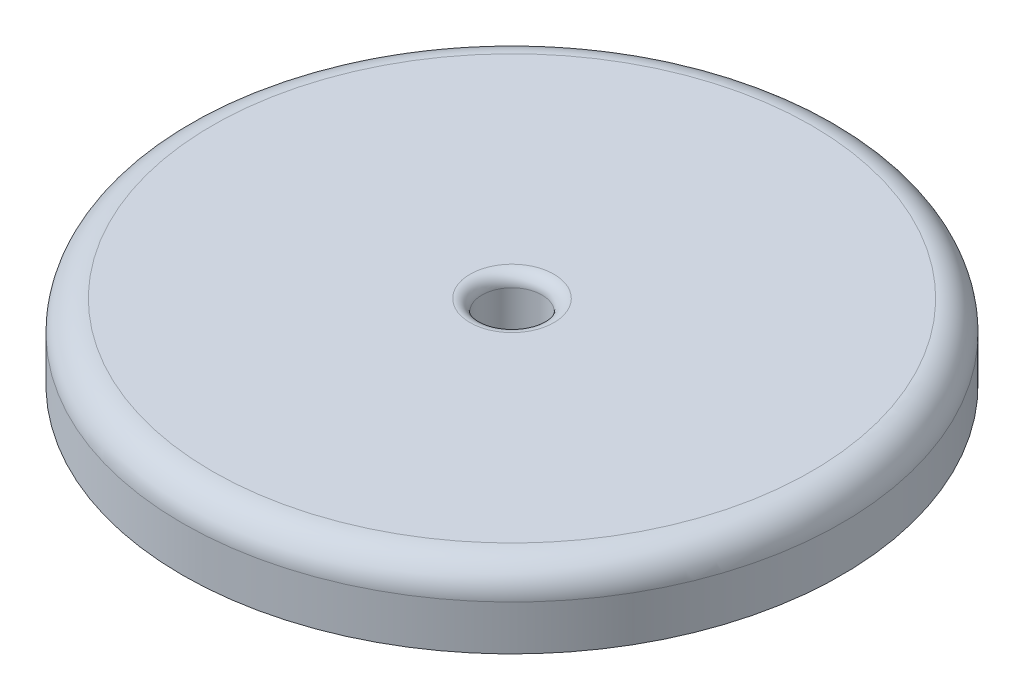
ISO-10303-21;
HEADER;
FILE_DESCRIPTION(('STEP AP214'),'2;1');
FILE_NAME('part.step','',(''),(''),'','','');
FILE_SCHEMA(('AUTOMOTIVE_DESIGN { 1 0 10303 214 1 1 1 1 }'));
ENDSEC;
DATA;
#1=APPLICATION_CONTEXT('core data for automotive mechanical design processes');
#2=APPLICATION_PROTOCOL_DEFINITION('international standard','automotive_design',2000,#1);
#3=PRODUCT_CONTEXT('',#1,'mechanical');
#4=PRODUCT('Part','Part','',(#3));
#5=PRODUCT_RELATED_PRODUCT_CATEGORY('part','',(#4));
#6=PRODUCT_DEFINITION_FORMATION('','',#4);
#7=PRODUCT_DEFINITION_CONTEXT('part definition',#1,'design');
#8=PRODUCT_DEFINITION('design','',#6,#7);
#9=PRODUCT_DEFINITION_SHAPE('','',#8);
#10=(LENGTH_UNIT() NAMED_UNIT(*) SI_UNIT(.MILLI.,.METRE.));
#11=(NAMED_UNIT(*) PLANE_ANGLE_UNIT() SI_UNIT($,.RADIAN.));
#12=(NAMED_UNIT(*) SI_UNIT($,.STERADIAN.) SOLID_ANGLE_UNIT());
#13=UNCERTAINTY_MEASURE_WITH_UNIT(LENGTH_MEASURE(1.E-05),#10,'distance_accuracy_value','');
#14=(GEOMETRIC_REPRESENTATION_CONTEXT(3) GLOBAL_UNCERTAINTY_ASSIGNED_CONTEXT((#13)) GLOBAL_UNIT_ASSIGNED_CONTEXT((#10,
#11,#12)) REPRESENTATION_CONTEXT('',''));
#15=CARTESIAN_POINT('',(0.,0.,0.));
#16=DIRECTION('',(0.,0.,1.));
#17=DIRECTION('',(1.,0.,0.));
#18=AXIS2_PLACEMENT_3D('',#15,#16,#17);
#19=CARTESIAN_POINT('',(0.,2.5,0.));
#20=DIRECTION('',(0.,-1.,0.));
#21=DIRECTION('',(0.,0.,-1.));
#22=AXIS2_PLACEMENT_3D('',#19,#20,#21);
#23=CYLINDRICAL_SURFACE('',#22,11.);
#24=CARTESIAN_POINT('',(0.,1.5,0.));
#25=DIRECTION('',(0.,1.,0.));
#26=DIRECTION('',(0.,0.,1.));
#27=AXIS2_PLACEMENT_3D('',#24,#25,#26);
#28=CIRCLE('',#27,11.);
#29=CARTESIAN_POINT('',(0.,1.5,11.));
#30=VERTEX_POINT('',#29);
#31=EDGE_CURVE('E51',#30,#30,#28,.F.);
#32=ORIENTED_EDGE('',*,*,#31,.T.);
#33=EDGE_LOOP('',(#32));
#34=FACE_BOUND('',#33,.T.);
#35=CARTESIAN_POINT('',(0.,0.,0.));
#36=DIRECTION('',(0.,1.,0.));
#37=DIRECTION('',(0.,0.,1.));
#38=AXIS2_PLACEMENT_3D('',#35,#36,#37);
#39=CIRCLE('',#38,11.);
#40=CARTESIAN_POINT('',(0.,0.,11.));
#41=VERTEX_POINT('',#40);
#42=EDGE_CURVE('E63',#41,#41,#39,.T.);
#43=ORIENTED_EDGE('',*,*,#42,.T.);
#44=EDGE_LOOP('',(#43));
#45=FACE_BOUND('',#44,.T.);
#46=ADVANCED_FACE('F31',(#34,#45),#23,.T.);
#47=CARTESIAN_POINT('',(0.,2.5,0.));
#48=DIRECTION('',(0.,1.,0.));
#49=DIRECTION('',(0.,0.,1.));
#50=AXIS2_PLACEMENT_3D('',#47,#48,#49);
#51=PLANE('',#50);
#52=CARTESIAN_POINT('',(0.,2.5,0.));
#53=DIRECTION('',(0.,1.,0.));
#54=DIRECTION('',(0.,0.,1.));
#55=AXIS2_PLACEMENT_3D('',#52,#53,#54);
#56=CIRCLE('',#55,10.);
#57=CARTESIAN_POINT('',(0.,2.5,10.));
#58=VERTEX_POINT('',#57);
#59=EDGE_CURVE('E54',#58,#58,#56,.T.);
#60=ORIENTED_EDGE('',*,*,#59,.T.);
#61=EDGE_LOOP('',(#60));
#62=FACE_BOUND('',#61,.T.);
#63=CARTESIAN_POINT('',(0.,2.5,0.));
#64=DIRECTION('',(0.,1.,0.));
#65=DIRECTION('',(0.,0.,1.));
#66=AXIS2_PLACEMENT_3D('',#63,#64,#65);
#67=CIRCLE('',#66,1.4);
#68=CARTESIAN_POINT('',(0.,2.5,1.4));
#69=VERTEX_POINT('',#68);
#70=EDGE_CURVE('E57',#69,#69,#67,.F.);
#71=ORIENTED_EDGE('',*,*,#70,.T.);
#72=EDGE_LOOP('',(#71));
#73=FACE_BOUND('',#72,.T.);
#74=ADVANCED_FACE('F88',(#62,#73),#51,.T.);
#75=CARTESIAN_POINT('',(0.,0.,0.));
#76=DIRECTION('',(0.,1.,0.));
#77=DIRECTION('',(0.,0.,1.));
#78=AXIS2_PLACEMENT_3D('',#75,#76,#77);
#79=PLANE('',#78);
#80=CARTESIAN_POINT('',(0.,0.,0.));
#81=DIRECTION('',(0.,1.,0.));
#82=DIRECTION('',(0.,0.,1.));
#83=AXIS2_PLACEMENT_3D('',#80,#81,#82);
#84=CIRCLE('',#83,9.7);
#85=CARTESIAN_POINT('',(0.,0.,9.7));
#86=VERTEX_POINT('',#85);
#87=EDGE_CURVE('E38',#86,#86,#84,.T.);
#88=ORIENTED_EDGE('',*,*,#87,.T.);
#89=EDGE_LOOP('',(#88));
#90=FACE_BOUND('',#89,.T.);
#91=ORIENTED_EDGE('',*,*,#42,.F.);
#92=EDGE_LOOP('',(#91));
#93=FACE_BOUND('',#92,.T.);
#94=ADVANCED_FACE('F94',(#90,#93),#79,.F.);
#95=CARTESIAN_POINT('',(0.,0.,0.));
#96=DIRECTION('',(0.,1.,0.));
#97=DIRECTION('',(0.,0.,1.));
#98=AXIS2_PLACEMENT_3D('',#95,#96,#97);
#99=CYLINDRICAL_SURFACE('',#98,1.);
#100=CARTESIAN_POINT('',(0.,2.1,0.));
#101=DIRECTION('',(0.,1.,0.));
#102=DIRECTION('',(0.,0.,1.));
#103=AXIS2_PLACEMENT_3D('',#100,#101,#102);
#104=CIRCLE('',#103,1.);
#105=CARTESIAN_POINT('',(0.,2.1,1.));
#106=VERTEX_POINT('',#105);
#107=EDGE_CURVE('E60',#106,#106,#104,.T.);
#108=ORIENTED_EDGE('',*,*,#107,.T.);
#109=EDGE_LOOP('',(#108));
#110=FACE_BOUND('',#109,.T.);
#111=CARTESIAN_POINT('',(0.,-0.5,0.));
#112=DIRECTION('',(0.,-1.,0.));
#113=DIRECTION('',(0.,0.,-1.));
#114=AXIS2_PLACEMENT_3D('',#111,#112,#113);
#115=CIRCLE('',#114,1.);
#116=CARTESIAN_POINT('',(0.,-0.5,-1.));
#117=VERTEX_POINT('',#116);
#118=EDGE_CURVE('E66',#117,#117,#115,.T.);
#119=ORIENTED_EDGE('',*,*,#118,.T.);
#120=EDGE_LOOP('',(#119));
#121=FACE_BOUND('',#120,.T.);
#122=ADVANCED_FACE('F70',(#110,#121),#99,.F.);
#123=CARTESIAN_POINT('',(0.,2.1,0.));
#124=DIRECTION('',(0.,1.,0.));
#125=DIRECTION('',(0.,0.,1.));
#126=AXIS2_PLACEMENT_3D('',#123,#124,#125);
#127=TOROIDAL_SURFACE('',#126,1.4,0.4);
#128=ORIENTED_EDGE('',*,*,#70,.F.);
#129=EDGE_LOOP('',(#128));
#130=FACE_BOUND('',#129,.T.);
#131=ORIENTED_EDGE('',*,*,#107,.F.);
#132=EDGE_LOOP('',(#131));
#133=FACE_BOUND('',#132,.T.);
#134=ADVANCED_FACE('F84',(#130,#133),#127,.T.);
#135=CARTESIAN_POINT('',(0.,1.5,0.));
#136=DIRECTION('',(0.,1.,0.));
#137=DIRECTION('',(0.,0.,1.));
#138=AXIS2_PLACEMENT_3D('',#135,#136,#137);
#139=TOROIDAL_SURFACE('',#138,10.,1.);
#140=ORIENTED_EDGE('',*,*,#31,.F.);
#141=EDGE_LOOP('',(#140));
#142=FACE_BOUND('',#141,.T.);
#143=ORIENTED_EDGE('',*,*,#59,.F.);
#144=EDGE_LOOP('',(#143));
#145=FACE_BOUND('',#144,.T.);
#146=ADVANCED_FACE('F75',(#142,#145),#139,.T.);
#147=CARTESIAN_POINT('',(0.,-0.5,0.));
#148=DIRECTION('',(0.,-1.,0.));
#149=DIRECTION('',(0.,0.,-1.));
#150=AXIS2_PLACEMENT_3D('',#147,#148,#149);
#151=PLANE('',#150);
#152=CARTESIAN_POINT('',(0.,-0.5,0.));
#153=DIRECTION('',(0.,-1.,0.));
#154=DIRECTION('',(0.,0.,-1.));
#155=AXIS2_PLACEMENT_3D('',#152,#153,#154);
#156=CIRCLE('',#155,9.3);
#157=CARTESIAN_POINT('',(0.,-0.5,-9.3));
#158=VERTEX_POINT('',#157);
#159=EDGE_CURVE('E10',#158,#158,#156,.T.);
#160=ORIENTED_EDGE('',*,*,#159,.T.);
#161=EDGE_LOOP('',(#160));
#162=FACE_BOUND('',#161,.T.);
#163=ORIENTED_EDGE('',*,*,#118,.F.);
#164=EDGE_LOOP('',(#163));
#165=FACE_BOUND('',#164,.T.);
#166=ADVANCED_FACE('F72',(#162,#165),#151,.T.);
#167=CARTESIAN_POINT('',(0.,-0.5,0.));
#168=DIRECTION('',(0.,1.,0.));
#169=DIRECTION('',(0.,0.,1.));
#170=AXIS2_PLACEMENT_3D('',#167,#168,#169);
#171=CYLINDRICAL_SURFACE('',#170,9.5);
#172=CARTESIAN_POINT('',(0.,-0.2,0.));
#173=DIRECTION('',(0.,1.,0.));
#174=DIRECTION('',(0.,0.,1.));
#175=AXIS2_PLACEMENT_3D('',#172,#173,#174);
#176=CIRCLE('',#175,9.5);
#177=CARTESIAN_POINT('',(0.,-0.2,9.5));
#178=VERTEX_POINT('',#177);
#179=EDGE_CURVE('E42',#178,#178,#176,.F.);
#180=ORIENTED_EDGE('',*,*,#179,.T.);
#181=EDGE_LOOP('',(#180));
#182=FACE_BOUND('',#181,.T.);
#183=CARTESIAN_POINT('',(0.,-0.3,0.));
#184=DIRECTION('',(0.,-1.,0.));
#185=DIRECTION('',(0.,0.,-1.));
#186=AXIS2_PLACEMENT_3D('',#183,#184,#185);
#187=CIRCLE('',#186,9.5);
#188=CARTESIAN_POINT('',(0.,-0.3,-9.5));
#189=VERTEX_POINT('',#188);
#190=EDGE_CURVE('E46',#189,#189,#187,.F.);
#191=ORIENTED_EDGE('',*,*,#190,.T.);
#192=EDGE_LOOP('',(#191));
#193=FACE_BOUND('',#192,.T.);
#194=ADVANCED_FACE('F74',(#182,#193),#171,.T.);
#195=CARTESIAN_POINT('',(0.,-0.2,0.));
#196=DIRECTION('',(0.,1.,0.));
#197=DIRECTION('',(0.,0.,1.));
#198=AXIS2_PLACEMENT_3D('',#195,#196,#197);
#199=TOROIDAL_SURFACE('',#198,9.7,0.2);
#200=ORIENTED_EDGE('',*,*,#87,.F.);
#201=EDGE_LOOP('',(#200));
#202=FACE_BOUND('',#201,.T.);
#203=ORIENTED_EDGE('',*,*,#179,.F.);
#204=EDGE_LOOP('',(#203));
#205=FACE_BOUND('',#204,.T.);
#206=ADVANCED_FACE('F81',(#202,#205),#199,.F.);
#207=CARTESIAN_POINT('',(0.,-0.3,0.));
#208=DIRECTION('',(0.,-1.,0.));
#209=DIRECTION('',(0.,0.,-1.));
#210=AXIS2_PLACEMENT_3D('',#207,#208,#209);
#211=TOROIDAL_SURFACE('',#210,9.3,0.2);
#212=ORIENTED_EDGE('',*,*,#190,.F.);
#213=EDGE_LOOP('',(#212));
#214=FACE_BOUND('',#213,.T.);
#215=ORIENTED_EDGE('',*,*,#159,.F.);
#216=EDGE_LOOP('',(#215));
#217=FACE_BOUND('',#216,.T.);
#218=ADVANCED_FACE('F33',(#214,#217),#211,.T.);
#219=CLOSED_SHELL('',(#46,#74,#94,#122,#134,#146,#166,#194,#206,#218));
#220=MANIFOLD_SOLID_BREP('B2',#219);
#221=ADVANCED_BREP_SHAPE_REPRESENTATION('',(#18,#220),#14);
#222=SHAPE_DEFINITION_REPRESENTATION(#9,#221);
ENDSEC;
END-ISO-10303-21;
